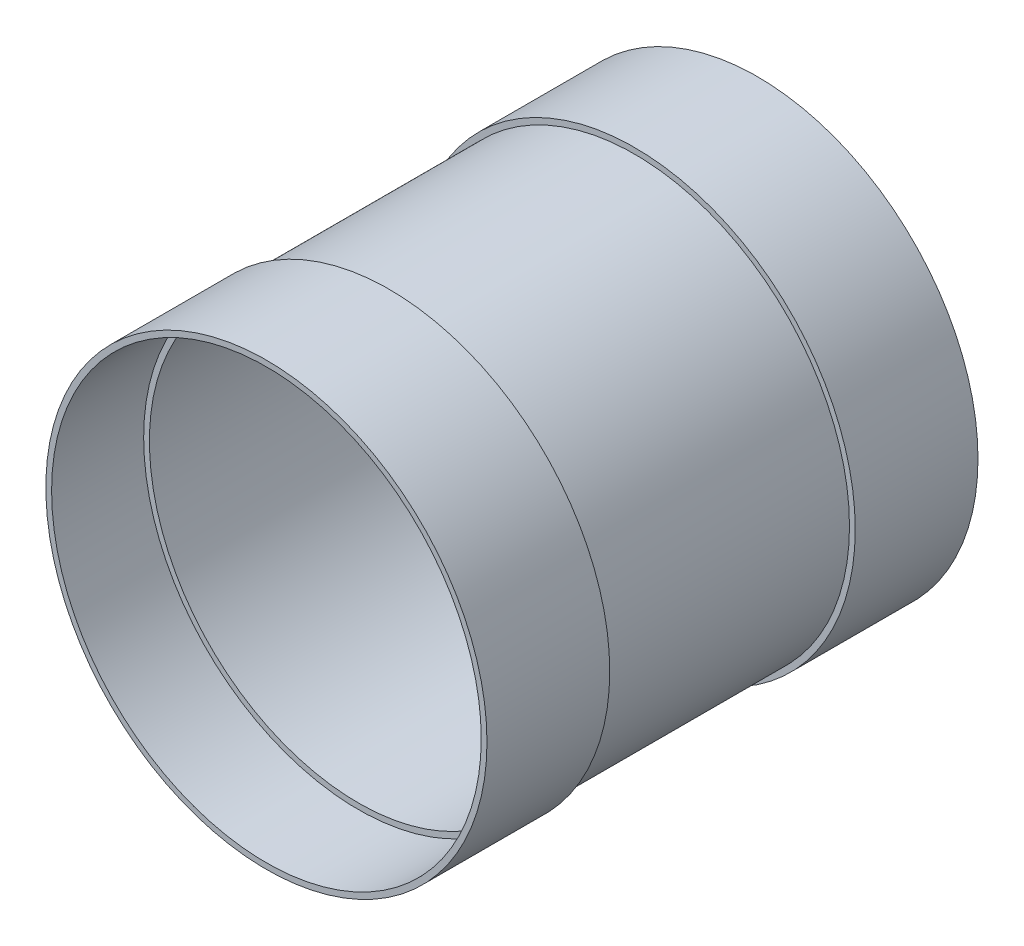
ISO-10303-21;
HEADER;
FILE_DESCRIPTION(('STEP AP214'),'2;1');
FILE_NAME('part.step','',(''),(''),'','','');
FILE_SCHEMA(('AUTOMOTIVE_DESIGN { 1 0 10303 214 1 1 1 1 }'));
ENDSEC;
DATA;
#1=APPLICATION_CONTEXT('core data for automotive mechanical design processes');
#2=APPLICATION_PROTOCOL_DEFINITION('international standard','automotive_design',2000,#1);
#3=PRODUCT_CONTEXT('',#1,'mechanical');
#4=PRODUCT('Part','Part','',(#3));
#5=PRODUCT_RELATED_PRODUCT_CATEGORY('part','',(#4));
#6=PRODUCT_DEFINITION_FORMATION('','',#4);
#7=PRODUCT_DEFINITION_CONTEXT('part definition',#1,'design');
#8=PRODUCT_DEFINITION('design','',#6,#7);
#9=PRODUCT_DEFINITION_SHAPE('','',#8);
#10=(LENGTH_UNIT() NAMED_UNIT(*) SI_UNIT(.MILLI.,.METRE.));
#11=(NAMED_UNIT(*) PLANE_ANGLE_UNIT() SI_UNIT($,.RADIAN.));
#12=(NAMED_UNIT(*) SI_UNIT($,.STERADIAN.) SOLID_ANGLE_UNIT());
#13=UNCERTAINTY_MEASURE_WITH_UNIT(LENGTH_MEASURE(1.E-05),#10,'distance_accuracy_value','');
#14=(GEOMETRIC_REPRESENTATION_CONTEXT(3) GLOBAL_UNCERTAINTY_ASSIGNED_CONTEXT((#13)) GLOBAL_UNIT_ASSIGNED_CONTEXT((#10,
#11,#12)) REPRESENTATION_CONTEXT('',''));
#15=CARTESIAN_POINT('',(0.,0.,0.));
#16=DIRECTION('',(0.,0.,1.));
#17=DIRECTION('',(1.,0.,0.));
#18=AXIS2_PLACEMENT_3D('',#15,#16,#17);
#19=CARTESIAN_POINT('',(0.,173.0375,127.));
#20=DIRECTION('',(0.,0.,-1.));
#21=DIRECTION('',(-1.,0.,0.));
#22=AXIS2_PLACEMENT_3D('',#19,#20,#21);
#23=PLANE('',#22);
#24=CARTESIAN_POINT('',(0.,0.,127.));
#25=DIRECTION('',(0.,0.,1.));
#26=DIRECTION('',(1.,0.,0.));
#27=AXIS2_PLACEMENT_3D('',#24,#25,#26);
#28=CIRCLE('',#27,173.0375);
#29=CARTESIAN_POINT('',(173.0375,0.,127.));
#30=VERTEX_POINT('',#29);
#31=EDGE_CURVE('E73',#30,#30,#28,.T.);
#32=ORIENTED_EDGE('',*,*,#31,.F.);
#33=EDGE_LOOP('',(#32));
#34=FACE_BOUND('',#33,.T.);
#35=CARTESIAN_POINT('',(0.,0.,127.));
#36=DIRECTION('',(0.,0.,1.));
#37=DIRECTION('',(1.,0.,0.));
#38=AXIS2_PLACEMENT_3D('',#35,#36,#37);
#39=CIRCLE('',#38,177.8);
#40=CARTESIAN_POINT('',(177.8,0.,127.));
#41=VERTEX_POINT('',#40);
#42=EDGE_CURVE('E11',#41,#41,#39,.T.);
#43=ORIENTED_EDGE('',*,*,#42,.T.);
#44=EDGE_LOOP('',(#43));
#45=FACE_BOUND('',#44,.T.);
#46=ADVANCED_FACE('F52',(#34,#45),#23,.F.);
#47=CARTESIAN_POINT('',(0.,0.,0.));
#48=DIRECTION('',(0.,0.,1.));
#49=DIRECTION('',(1.,0.,0.));
#50=AXIS2_PLACEMENT_3D('',#47,#48,#49);
#51=CYLINDRICAL_SURFACE('',#50,177.8);
#52=ORIENTED_EDGE('',*,*,#42,.F.);
#53=EDGE_LOOP('',(#52));
#54=FACE_BOUND('',#53,.T.);
#55=CARTESIAN_POINT('',(0.,0.,-127.));
#56=DIRECTION('',(0.,0.,1.));
#57=DIRECTION('',(1.,0.,0.));
#58=AXIS2_PLACEMENT_3D('',#55,#56,#57);
#59=CIRCLE('',#58,177.8);
#60=CARTESIAN_POINT('',(177.8,0.,-127.));
#61=VERTEX_POINT('',#60);
#62=EDGE_CURVE('E59',#61,#61,#59,.T.);
#63=ORIENTED_EDGE('',*,*,#62,.T.);
#64=EDGE_LOOP('',(#63));
#65=FACE_BOUND('',#64,.T.);
#66=ADVANCED_FACE('F85',(#54,#65),#51,.T.);
#67=CARTESIAN_POINT('',(0.,173.0375,-127.));
#68=DIRECTION('',(0.,0.,1.));
#69=DIRECTION('',(1.,0.,0.));
#70=AXIS2_PLACEMENT_3D('',#67,#68,#69);
#71=PLANE('',#70);
#72=ORIENTED_EDGE('',*,*,#62,.F.);
#73=EDGE_LOOP('',(#72));
#74=FACE_BOUND('',#73,.T.);
#75=CARTESIAN_POINT('',(0.,0.,-127.));
#76=DIRECTION('',(0.,0.,1.));
#77=DIRECTION('',(1.,0.,0.));
#78=AXIS2_PLACEMENT_3D('',#75,#76,#77);
#79=CIRCLE('',#78,173.0375);
#80=CARTESIAN_POINT('',(173.0375,0.,-127.));
#81=VERTEX_POINT('',#80);
#82=EDGE_CURVE('E66',#81,#81,#79,.T.);
#83=ORIENTED_EDGE('',*,*,#82,.T.);
#84=EDGE_LOOP('',(#83));
#85=FACE_BOUND('',#84,.T.);
#86=ADVANCED_FACE('F89',(#74,#85),#71,.F.);
#87=CARTESIAN_POINT('',(0.,0.,0.));
#88=DIRECTION('',(0.,0.,1.));
#89=DIRECTION('',(1.,0.,0.));
#90=AXIS2_PLACEMENT_3D('',#87,#88,#89);
#91=CYLINDRICAL_SURFACE('',#90,173.0375);
#92=ORIENTED_EDGE('',*,*,#82,.F.);
#93=EDGE_LOOP('',(#92));
#94=FACE_BOUND('',#93,.T.);
#95=ORIENTED_EDGE('',*,*,#31,.T.);
#96=EDGE_LOOP('',(#95));
#97=FACE_BOUND('',#96,.T.);
#98=ADVANCED_FACE('F82',(#94,#97),#91,.F.);
#99=CLOSED_SHELL('',(#46,#66,#86,#98));
#100=MANIFOLD_SOLID_BREP('B2',#99);
#101=CARTESIAN_POINT('',(0.,182.5625,-101.6));
#102=DIRECTION('',(0.,0.,-1.));
#103=DIRECTION('',(-1.,0.,0.));
#104=AXIS2_PLACEMENT_3D('',#101,#102,#103);
#105=PLANE('',#104);
#106=CARTESIAN_POINT('',(0.,0.,-101.6));
#107=DIRECTION('',(0.,0.,1.));
#108=DIRECTION('',(1.,0.,0.));
#109=AXIS2_PLACEMENT_3D('',#106,#107,#108);
#110=CIRCLE('',#109,177.8);
#111=CARTESIAN_POINT('',(177.8,0.,-101.6));
#112=VERTEX_POINT('',#111);
#113=EDGE_CURVE('E51',#112,#112,#110,.T.);
#114=ORIENTED_EDGE('',*,*,#113,.F.);
#115=EDGE_LOOP('',(#114));
#116=FACE_BOUND('',#115,.T.);
#117=CARTESIAN_POINT('',(0.,0.,-101.6));
#118=DIRECTION('',(0.,0.,1.));
#119=DIRECTION('',(1.,0.,0.));
#120=AXIS2_PLACEMENT_3D('',#117,#118,#119);
#121=CIRCLE('',#120,182.5625);
#122=CARTESIAN_POINT('',(182.5625,0.,-101.6));
#123=VERTEX_POINT('',#122);
#124=EDGE_CURVE('E160',#123,#123,#121,.T.);
#125=ORIENTED_EDGE('',*,*,#124,.T.);
#126=EDGE_LOOP('',(#125));
#127=FACE_BOUND('',#126,.T.);
#128=ADVANCED_FACE('F141',(#116,#127),#105,.F.);
#129=CARTESIAN_POINT('',(0.,0.,62.5945817490495));
#130=DIRECTION('',(0.,0.,1.));
#131=DIRECTION('',(1.,0.,0.));
#132=AXIS2_PLACEMENT_3D('',#129,#130,#131);
#133=CYLINDRICAL_SURFACE('',#132,177.8);
#134=CARTESIAN_POINT('',(0.,0.,-203.2));
#135=DIRECTION('',(0.,0.,1.));
#136=DIRECTION('',(1.,0.,0.));
#137=AXIS2_PLACEMENT_3D('',#134,#135,#136);
#138=CIRCLE('',#137,177.8);
#139=CARTESIAN_POINT('',(177.8,0.,-203.2));
#140=VERTEX_POINT('',#139);
#141=EDGE_CURVE('E148',#140,#140,#138,.T.);
#142=ORIENTED_EDGE('',*,*,#141,.F.);
#143=EDGE_LOOP('',(#142));
#144=FACE_BOUND('',#143,.T.);
#145=ORIENTED_EDGE('',*,*,#113,.T.);
#146=EDGE_LOOP('',(#145));
#147=FACE_BOUND('',#146,.T.);
#148=ADVANCED_FACE('F177',(#144,#147),#133,.F.);
#149=CARTESIAN_POINT('',(0.,182.5625,-203.2));
#150=DIRECTION('',(0.,0.,1.));
#151=DIRECTION('',(1.,0.,0.));
#152=AXIS2_PLACEMENT_3D('',#149,#150,#151);
#153=PLANE('',#152);
#154=CARTESIAN_POINT('',(0.,0.,-203.2));
#155=DIRECTION('',(0.,0.,1.));
#156=DIRECTION('',(1.,0.,0.));
#157=AXIS2_PLACEMENT_3D('',#154,#155,#156);
#158=CIRCLE('',#157,182.5625);
#159=CARTESIAN_POINT('',(182.5625,0.,-203.2));
#160=VERTEX_POINT('',#159);
#161=EDGE_CURVE('E154',#160,#160,#158,.T.);
#162=ORIENTED_EDGE('',*,*,#161,.F.);
#163=EDGE_LOOP('',(#162));
#164=FACE_BOUND('',#163,.T.);
#165=ORIENTED_EDGE('',*,*,#141,.T.);
#166=EDGE_LOOP('',(#165));
#167=FACE_BOUND('',#166,.T.);
#168=ADVANCED_FACE('F172',(#164,#167),#153,.F.);
#169=CARTESIAN_POINT('',(0.,0.,62.5945817490495));
#170=DIRECTION('',(0.,0.,1.));
#171=DIRECTION('',(1.,0.,0.));
#172=AXIS2_PLACEMENT_3D('',#169,#170,#171);
#173=CYLINDRICAL_SURFACE('',#172,182.5625);
#174=ORIENTED_EDGE('',*,*,#124,.F.);
#175=EDGE_LOOP('',(#174));
#176=FACE_BOUND('',#175,.T.);
#177=ORIENTED_EDGE('',*,*,#161,.T.);
#178=EDGE_LOOP('',(#177));
#179=FACE_BOUND('',#178,.T.);
#180=ADVANCED_FACE('F169',(#176,#179),#173,.T.);
#181=CLOSED_SHELL('',(#128,#148,#168,#180));
#182=MANIFOLD_SOLID_BREP('B6',#181);
#183=CARTESIAN_POINT('',(0.,177.8,203.2));
#184=DIRECTION('',(0.,0.,-1.));
#185=DIRECTION('',(-1.,0.,0.));
#186=AXIS2_PLACEMENT_3D('',#183,#184,#185);
#187=PLANE('',#186);
#188=CARTESIAN_POINT('',(0.,0.,203.2));
#189=DIRECTION('',(0.,0.,1.));
#190=DIRECTION('',(1.,0.,0.));
#191=AXIS2_PLACEMENT_3D('',#188,#189,#190);
#192=CIRCLE('',#191,177.8);
#193=CARTESIAN_POINT('',(177.8,0.,203.2));
#194=VERTEX_POINT('',#193);
#195=EDGE_CURVE('E238',#194,#194,#192,.T.);
#196=ORIENTED_EDGE('',*,*,#195,.F.);
#197=EDGE_LOOP('',(#196));
#198=FACE_BOUND('',#197,.T.);
#199=CARTESIAN_POINT('',(0.,0.,203.2));
#200=DIRECTION('',(0.,0.,1.));
#201=DIRECTION('',(1.,0.,0.));
#202=AXIS2_PLACEMENT_3D('',#199,#200,#201);
#203=CIRCLE('',#202,182.5625);
#204=CARTESIAN_POINT('',(182.5625,0.,203.2));
#205=VERTEX_POINT('',#204);
#206=EDGE_CURVE('E140',#205,#205,#203,.T.);
#207=ORIENTED_EDGE('',*,*,#206,.T.);
#208=EDGE_LOOP('',(#207));
#209=FACE_BOUND('',#208,.T.);
#210=ADVANCED_FACE('F219',(#198,#209),#187,.F.);
#211=CARTESIAN_POINT('',(0.,0.,62.5945817490495));
#212=DIRECTION('',(0.,0.,1.));
#213=DIRECTION('',(1.,0.,0.));
#214=AXIS2_PLACEMENT_3D('',#211,#212,#213);
#215=CYLINDRICAL_SURFACE('',#214,182.5625);
#216=ORIENTED_EDGE('',*,*,#206,.F.);
#217=EDGE_LOOP('',(#216));
#218=FACE_BOUND('',#217,.T.);
#219=CARTESIAN_POINT('',(0.,0.,101.6));
#220=DIRECTION('',(0.,0.,1.));
#221=DIRECTION('',(1.,0.,0.));
#222=AXIS2_PLACEMENT_3D('',#219,#220,#221);
#223=CIRCLE('',#222,182.5625);
#224=CARTESIAN_POINT('',(182.5625,0.,101.6));
#225=VERTEX_POINT('',#224);
#226=EDGE_CURVE('E226',#225,#225,#223,.T.);
#227=ORIENTED_EDGE('',*,*,#226,.T.);
#228=EDGE_LOOP('',(#227));
#229=FACE_BOUND('',#228,.T.);
#230=ADVANCED_FACE('F249',(#218,#229),#215,.T.);
#231=CARTESIAN_POINT('',(0.,182.5625,101.6));
#232=DIRECTION('',(0.,0.,1.));
#233=DIRECTION('',(1.,0.,0.));
#234=AXIS2_PLACEMENT_3D('',#231,#232,#233);
#235=PLANE('',#234);
#236=ORIENTED_EDGE('',*,*,#226,.F.);
#237=EDGE_LOOP('',(#236));
#238=FACE_BOUND('',#237,.T.);
#239=CARTESIAN_POINT('',(0.,0.,101.6));
#240=DIRECTION('',(0.,0.,1.));
#241=DIRECTION('',(1.,0.,0.));
#242=AXIS2_PLACEMENT_3D('',#239,#240,#241);
#243=CIRCLE('',#242,177.8);
#244=CARTESIAN_POINT('',(177.8,0.,101.6));
#245=VERTEX_POINT('',#244);
#246=EDGE_CURVE('E232',#245,#245,#243,.T.);
#247=ORIENTED_EDGE('',*,*,#246,.T.);
#248=EDGE_LOOP('',(#247));
#249=FACE_BOUND('',#248,.T.);
#250=ADVANCED_FACE('F253',(#238,#249),#235,.F.);
#251=CARTESIAN_POINT('',(0.,0.,62.5945817490495));
#252=DIRECTION('',(0.,0.,1.));
#253=DIRECTION('',(1.,0.,0.));
#254=AXIS2_PLACEMENT_3D('',#251,#252,#253);
#255=CYLINDRICAL_SURFACE('',#254,177.8);
#256=ORIENTED_EDGE('',*,*,#246,.F.);
#257=EDGE_LOOP('',(#256));
#258=FACE_BOUND('',#257,.T.);
#259=ORIENTED_EDGE('',*,*,#195,.T.);
#260=EDGE_LOOP('',(#259));
#261=FACE_BOUND('',#260,.T.);
#262=ADVANCED_FACE('F246',(#258,#261),#255,.F.);
#263=CLOSED_SHELL('',(#210,#230,#250,#262));
#264=MANIFOLD_SOLID_BREP('B46',#263);
#265=ADVANCED_BREP_SHAPE_REPRESENTATION('',(#18,#100,#182,#264),#14);
#266=SHAPE_DEFINITION_REPRESENTATION(#9,#265);
ENDSEC;
END-ISO-10303-21;
